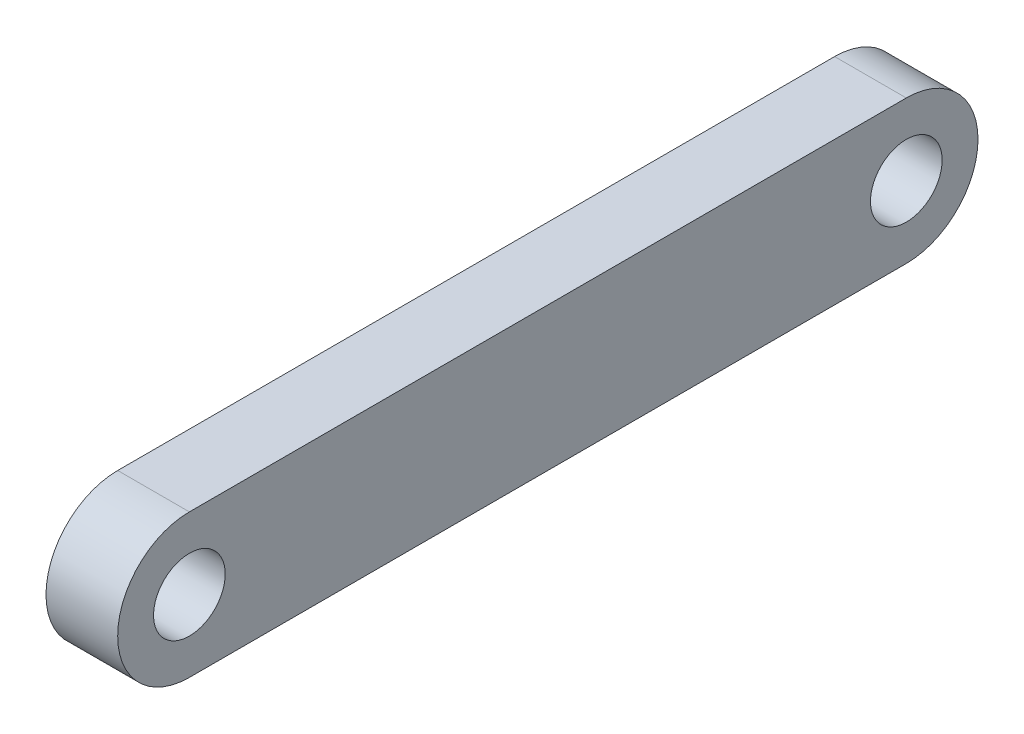
ISO-10303-21;
HEADER;
FILE_DESCRIPTION(('STEP AP214'),'2;1');
FILE_NAME('part.step','',(''),(''),'','','');
FILE_SCHEMA(('AUTOMOTIVE_DESIGN { 1 0 10303 214 1 1 1 1 }'));
ENDSEC;
DATA;
#1=APPLICATION_CONTEXT('core data for automotive mechanical design processes');
#2=APPLICATION_PROTOCOL_DEFINITION('international standard','automotive_design',2000,#1);
#3=PRODUCT_CONTEXT('',#1,'mechanical');
#4=PRODUCT('Part','Part','',(#3));
#5=PRODUCT_RELATED_PRODUCT_CATEGORY('part','',(#4));
#6=PRODUCT_DEFINITION_FORMATION('','',#4);
#7=PRODUCT_DEFINITION_CONTEXT('part definition',#1,'design');
#8=PRODUCT_DEFINITION('design','',#6,#7);
#9=PRODUCT_DEFINITION_SHAPE('','',#8);
#10=(LENGTH_UNIT() NAMED_UNIT(*) SI_UNIT(.MILLI.,.METRE.));
#11=(NAMED_UNIT(*) PLANE_ANGLE_UNIT() SI_UNIT($,.RADIAN.));
#12=(NAMED_UNIT(*) SI_UNIT($,.STERADIAN.) SOLID_ANGLE_UNIT());
#13=UNCERTAINTY_MEASURE_WITH_UNIT(LENGTH_MEASURE(1.E-05),#10,'distance_accuracy_value','');
#14=(GEOMETRIC_REPRESENTATION_CONTEXT(3) GLOBAL_UNCERTAINTY_ASSIGNED_CONTEXT((#13)) GLOBAL_UNIT_ASSIGNED_CONTEXT((#10,
#11,#12)) REPRESENTATION_CONTEXT('',''));
#15=CARTESIAN_POINT('',(0.,0.,0.));
#16=DIRECTION('',(0.,0.,1.));
#17=DIRECTION('',(1.,0.,0.));
#18=AXIS2_PLACEMENT_3D('',#15,#16,#17);
#19=CARTESIAN_POINT('',(8.,0.,0.));
#20=DIRECTION('',(1.,0.,0.));
#21=DIRECTION('',(0.,0.,-1.));
#22=AXIS2_PLACEMENT_3D('',#19,#20,#21);
#23=PLANE('',#22);
#24=CARTESIAN_POINT('',(8.,0.,0.));
#25=DIRECTION('',(1.,0.,0.));
#26=DIRECTION('',(0.,0.,-1.));
#27=AXIS2_PLACEMENT_3D('',#24,#25,#26);
#28=CIRCLE('',#27,4.);
#29=CARTESIAN_POINT('',(8.,0.,-4.));
#30=VERTEX_POINT('',#29);
#31=EDGE_CURVE('E101',#30,#30,#28,.T.);
#32=ORIENTED_EDGE('',*,*,#31,.F.);
#33=EDGE_LOOP('',(#32));
#34=FACE_BOUND('',#33,.T.);
#35=CARTESIAN_POINT('',(8.,0.,0.));
#36=DIRECTION('',(1.,0.,0.));
#37=DIRECTION('',(0.,0.,-1.));
#38=AXIS2_PLACEMENT_3D('',#35,#36,#37);
#39=CIRCLE('',#38,8.);
#40=CARTESIAN_POINT('',(8.,8.,0.));
#41=VERTEX_POINT('',#40);
#42=CARTESIAN_POINT('',(8.,-8.,0.));
#43=VERTEX_POINT('',#42);
#44=EDGE_CURVE('E86',#41,#43,#39,.T.);
#45=ORIENTED_EDGE('',*,*,#44,.T.);
#46=DIRECTION('',(0.,0.,-1.));
#47=VECTOR('',#46,1.);
#48=CARTESIAN_POINT('',(8.,-8.,0.));
#49=LINE('',#48,#47);
#50=CARTESIAN_POINT('',(8.,-8.,-80.));
#51=VERTEX_POINT('',#50);
#52=EDGE_CURVE('E81',#43,#51,#49,.T.);
#53=ORIENTED_EDGE('',*,*,#52,.T.);
#54=CARTESIAN_POINT('',(8.,0.,-80.));
#55=DIRECTION('',(1.,0.,0.));
#56=DIRECTION('',(0.,0.,-1.));
#57=AXIS2_PLACEMENT_3D('',#54,#55,#56);
#58=CIRCLE('',#57,8.);
#59=CARTESIAN_POINT('',(8.,8.00000000000001,-80.));
#60=VERTEX_POINT('',#59);
#61=EDGE_CURVE('E84',#51,#60,#58,.T.);
#62=ORIENTED_EDGE('',*,*,#61,.T.);
#63=DIRECTION('',(0.,0.,1.));
#64=VECTOR('',#63,1.);
#65=CARTESIAN_POINT('',(8.,8.,0.));
#66=LINE('',#65,#64);
#67=EDGE_CURVE('E51',#60,#41,#66,.T.);
#68=ORIENTED_EDGE('',*,*,#67,.T.);
#69=EDGE_LOOP('',(#45,#53,#62,#68));
#70=FACE_BOUND('',#69,.T.);
#71=CARTESIAN_POINT('',(8.,0.,-80.));
#72=DIRECTION('',(1.,0.,0.));
#73=DIRECTION('',(0.,0.,-1.));
#74=AXIS2_PLACEMENT_3D('',#71,#72,#73);
#75=CIRCLE('',#74,4.00000000000001);
#76=CARTESIAN_POINT('',(8.,0.,-84.));
#77=VERTEX_POINT('',#76);
#78=EDGE_CURVE('E116',#77,#77,#75,.T.);
#79=ORIENTED_EDGE('',*,*,#78,.F.);
#80=EDGE_LOOP('',(#79));
#81=FACE_BOUND('',#80,.T.);
#82=ADVANCED_FACE('F34',(#34,#70,#81),#23,.T.);
#83=CARTESIAN_POINT('',(0.,0.,0.));
#84=DIRECTION('',(1.,0.,0.));
#85=DIRECTION('',(0.,0.,-1.));
#86=AXIS2_PLACEMENT_3D('',#83,#84,#85);
#87=PLANE('',#86);
#88=CARTESIAN_POINT('',(0.,0.,0.));
#89=DIRECTION('',(1.,0.,0.));
#90=DIRECTION('',(0.,0.,-1.));
#91=AXIS2_PLACEMENT_3D('',#88,#89,#90);
#92=CIRCLE('',#91,4.);
#93=CARTESIAN_POINT('',(0.,0.,-4.));
#94=VERTEX_POINT('',#93);
#95=EDGE_CURVE('E113',#94,#94,#92,.T.);
#96=ORIENTED_EDGE('',*,*,#95,.T.);
#97=EDGE_LOOP('',(#96));
#98=FACE_BOUND('',#97,.T.);
#99=CARTESIAN_POINT('',(0.,0.,0.));
#100=DIRECTION('',(1.,0.,0.));
#101=DIRECTION('',(0.,0.,-1.));
#102=AXIS2_PLACEMENT_3D('',#99,#100,#101);
#103=CIRCLE('',#102,8.);
#104=CARTESIAN_POINT('',(0.,8.,0.));
#105=VERTEX_POINT('',#104);
#106=CARTESIAN_POINT('',(0.,-8.,0.));
#107=VERTEX_POINT('',#106);
#108=EDGE_CURVE('E98',#105,#107,#103,.T.);
#109=ORIENTED_EDGE('',*,*,#108,.F.);
#110=DIRECTION('',(0.,0.,1.));
#111=VECTOR('',#110,1.);
#112=CARTESIAN_POINT('',(0.,8.,0.));
#113=LINE('',#112,#111);
#114=CARTESIAN_POINT('',(0.,8.00000000000001,-80.));
#115=VERTEX_POINT('',#114);
#116=EDGE_CURVE('E74',#115,#105,#113,.T.);
#117=ORIENTED_EDGE('',*,*,#116,.F.);
#118=CARTESIAN_POINT('',(0.,0.,-80.));
#119=DIRECTION('',(1.,0.,0.));
#120=DIRECTION('',(0.,0.,-1.));
#121=AXIS2_PLACEMENT_3D('',#118,#119,#120);
#122=CIRCLE('',#121,8.);
#123=CARTESIAN_POINT('',(0.,-8.,-80.));
#124=VERTEX_POINT('',#123);
#125=EDGE_CURVE('E68',#124,#115,#122,.T.);
#126=ORIENTED_EDGE('',*,*,#125,.F.);
#127=DIRECTION('',(0.,0.,-1.));
#128=VECTOR('',#127,1.);
#129=CARTESIAN_POINT('',(0.,-8.,0.));
#130=LINE('',#129,#128);
#131=EDGE_CURVE('E90',#107,#124,#130,.T.);
#132=ORIENTED_EDGE('',*,*,#131,.F.);
#133=EDGE_LOOP('',(#109,#117,#126,#132));
#134=FACE_BOUND('',#133,.T.);
#135=CARTESIAN_POINT('',(0.,0.,-80.));
#136=DIRECTION('',(1.,0.,0.));
#137=DIRECTION('',(0.,0.,-1.));
#138=AXIS2_PLACEMENT_3D('',#135,#136,#137);
#139=CIRCLE('',#138,4.00000000000001);
#140=CARTESIAN_POINT('',(0.,0.,-84.));
#141=VERTEX_POINT('',#140);
#142=EDGE_CURVE('E119',#141,#141,#139,.T.);
#143=ORIENTED_EDGE('',*,*,#142,.T.);
#144=EDGE_LOOP('',(#143));
#145=FACE_BOUND('',#144,.T.);
#146=ADVANCED_FACE('F109',(#98,#134,#145),#87,.F.);
#147=CARTESIAN_POINT('',(8.,0.,0.));
#148=DIRECTION('',(-1.,0.,0.));
#149=DIRECTION('',(0.,0.,1.));
#150=AXIS2_PLACEMENT_3D('',#147,#148,#149);
#151=CYLINDRICAL_SURFACE('',#150,8.);
#152=ORIENTED_EDGE('',*,*,#108,.T.);
#153=DIRECTION('',(-1.,0.,0.));
#154=VECTOR('',#153,1.);
#155=CARTESIAN_POINT('',(8.,-8.,0.));
#156=LINE('',#155,#154);
#157=EDGE_CURVE('E11',#43,#107,#156,.T.);
#158=ORIENTED_EDGE('',*,*,#157,.F.);
#159=ORIENTED_EDGE('',*,*,#44,.F.);
#160=DIRECTION('',(-1.,0.,0.));
#161=VECTOR('',#160,1.);
#162=CARTESIAN_POINT('',(8.,8.,0.));
#163=LINE('',#162,#161);
#164=EDGE_CURVE('E94',#41,#105,#163,.T.);
#165=ORIENTED_EDGE('',*,*,#164,.T.);
#166=EDGE_LOOP('',(#152,#158,#159,#165));
#167=FACE_BOUND('',#166,.T.);
#168=ADVANCED_FACE('F36',(#167),#151,.T.);
#169=CARTESIAN_POINT('',(8.,-8.,0.));
#170=DIRECTION('',(0.,1.,0.));
#171=DIRECTION('',(0.,0.,1.));
#172=AXIS2_PLACEMENT_3D('',#169,#170,#171);
#173=PLANE('',#172);
#174=ORIENTED_EDGE('',*,*,#131,.T.);
#175=DIRECTION('',(-1.,0.,0.));
#176=VECTOR('',#175,1.);
#177=CARTESIAN_POINT('',(8.,-8.,-80.));
#178=LINE('',#177,#176);
#179=EDGE_CURVE('E43',#51,#124,#178,.T.);
#180=ORIENTED_EDGE('',*,*,#179,.F.);
#181=ORIENTED_EDGE('',*,*,#52,.F.);
#182=ORIENTED_EDGE('',*,*,#157,.T.);
#183=EDGE_LOOP('',(#174,#180,#181,#182));
#184=FACE_BOUND('',#183,.T.);
#185=ADVANCED_FACE('F89',(#184),#173,.F.);
#186=CARTESIAN_POINT('',(8.,0.,-80.));
#187=DIRECTION('',(-1.,0.,0.));
#188=DIRECTION('',(0.,0.,1.));
#189=AXIS2_PLACEMENT_3D('',#186,#187,#188);
#190=CYLINDRICAL_SURFACE('',#189,8.);
#191=ORIENTED_EDGE('',*,*,#125,.T.);
#192=DIRECTION('',(-1.,0.,0.));
#193=VECTOR('',#192,1.);
#194=CARTESIAN_POINT('',(8.,8.00000000000001,-80.));
#195=LINE('',#194,#193);
#196=EDGE_CURVE('E91',#60,#115,#195,.T.);
#197=ORIENTED_EDGE('',*,*,#196,.F.);
#198=ORIENTED_EDGE('',*,*,#61,.F.);
#199=ORIENTED_EDGE('',*,*,#179,.T.);
#200=EDGE_LOOP('',(#191,#197,#198,#199));
#201=FACE_BOUND('',#200,.T.);
#202=ADVANCED_FACE('F92',(#201),#190,.T.);
#203=CARTESIAN_POINT('',(8.,8.,0.));
#204=DIRECTION('',(0.,-1.,0.));
#205=DIRECTION('',(0.,0.,-1.));
#206=AXIS2_PLACEMENT_3D('',#203,#204,#205);
#207=PLANE('',#206);
#208=ORIENTED_EDGE('',*,*,#116,.T.);
#209=ORIENTED_EDGE('',*,*,#164,.F.);
#210=ORIENTED_EDGE('',*,*,#67,.F.);
#211=ORIENTED_EDGE('',*,*,#196,.T.);
#212=EDGE_LOOP('',(#208,#209,#210,#211));
#213=FACE_BOUND('',#212,.T.);
#214=ADVANCED_FACE('F106',(#213),#207,.F.);
#215=CARTESIAN_POINT('',(8.,0.,0.));
#216=DIRECTION('',(-1.,0.,0.));
#217=DIRECTION('',(0.,0.,1.));
#218=AXIS2_PLACEMENT_3D('',#215,#216,#217);
#219=CYLINDRICAL_SURFACE('',#218,4.);
#220=ORIENTED_EDGE('',*,*,#31,.T.);
#221=EDGE_LOOP('',(#220));
#222=FACE_BOUND('',#221,.T.);
#223=ORIENTED_EDGE('',*,*,#95,.F.);
#224=EDGE_LOOP('',(#223));
#225=FACE_BOUND('',#224,.T.);
#226=ADVANCED_FACE('F137',(#222,#225),#219,.F.);
#227=CARTESIAN_POINT('',(8.,0.,-80.));
#228=DIRECTION('',(-1.,0.,0.));
#229=DIRECTION('',(0.,0.,1.));
#230=AXIS2_PLACEMENT_3D('',#227,#228,#229);
#231=CYLINDRICAL_SURFACE('',#230,4.00000000000001);
#232=ORIENTED_EDGE('',*,*,#78,.T.);
#233=EDGE_LOOP('',(#232));
#234=FACE_BOUND('',#233,.T.);
#235=ORIENTED_EDGE('',*,*,#142,.F.);
#236=EDGE_LOOP('',(#235));
#237=FACE_BOUND('',#236,.T.);
#238=ADVANCED_FACE('F125',(#234,#237),#231,.F.);
#239=CLOSED_SHELL('',(#82,#146,#168,#185,#202,#214,#226,#238));
#240=MANIFOLD_SOLID_BREP('B2',#239);
#241=ADVANCED_BREP_SHAPE_REPRESENTATION('',(#18,#240),#14);
#242=SHAPE_DEFINITION_REPRESENTATION(#9,#241);
ENDSEC;
END-ISO-10303-21;
